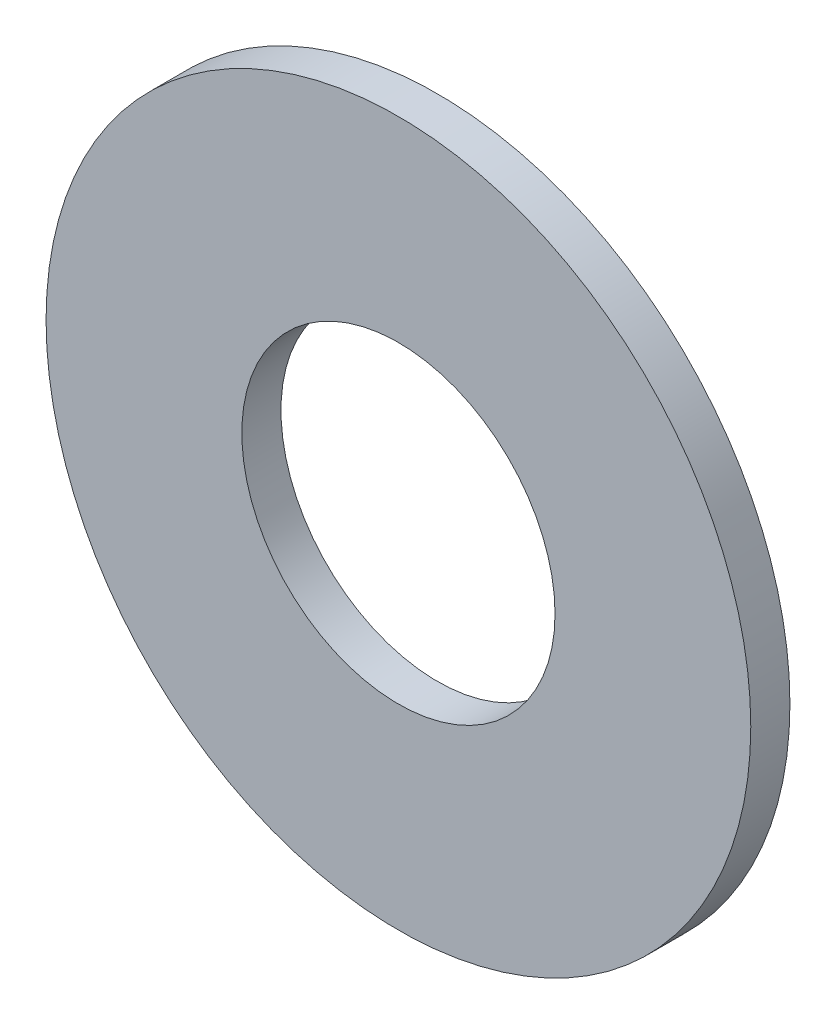
ISO-10303-21;
HEADER;
FILE_DESCRIPTION(('STEP AP214'),'2;1');
FILE_NAME('part.step','',(''),(''),'','','');
FILE_SCHEMA(('AUTOMOTIVE_DESIGN { 1 0 10303 214 1 1 1 1 }'));
ENDSEC;
DATA;
#1=APPLICATION_CONTEXT('core data for automotive mechanical design processes');
#2=APPLICATION_PROTOCOL_DEFINITION('international standard','automotive_design',2000,#1);
#3=PRODUCT_CONTEXT('',#1,'mechanical');
#4=PRODUCT('Part','Part','',(#3));
#5=PRODUCT_RELATED_PRODUCT_CATEGORY('part','',(#4));
#6=PRODUCT_DEFINITION_FORMATION('','',#4);
#7=PRODUCT_DEFINITION_CONTEXT('part definition',#1,'design');
#8=PRODUCT_DEFINITION('design','',#6,#7);
#9=PRODUCT_DEFINITION_SHAPE('','',#8);
#10=(LENGTH_UNIT() NAMED_UNIT(*) SI_UNIT(.MILLI.,.METRE.));
#11=(NAMED_UNIT(*) PLANE_ANGLE_UNIT() SI_UNIT($,.RADIAN.));
#12=(NAMED_UNIT(*) SI_UNIT($,.STERADIAN.) SOLID_ANGLE_UNIT());
#13=UNCERTAINTY_MEASURE_WITH_UNIT(LENGTH_MEASURE(1.E-05),#10,'distance_accuracy_value','');
#14=(GEOMETRIC_REPRESENTATION_CONTEXT(3) GLOBAL_UNCERTAINTY_ASSIGNED_CONTEXT((#13)) GLOBAL_UNIT_ASSIGNED_CONTEXT((#10,
#11,#12)) REPRESENTATION_CONTEXT('',''));
#15=CARTESIAN_POINT('',(0.,0.,0.));
#16=DIRECTION('',(0.,0.,1.));
#17=DIRECTION('',(1.,0.,0.));
#18=AXIS2_PLACEMENT_3D('',#15,#16,#17);
#19=CARTESIAN_POINT('',(0.,0.,1.));
#20=DIRECTION('',(0.,0.,1.));
#21=DIRECTION('',(1.,0.,0.));
#22=AXIS2_PLACEMENT_3D('',#19,#20,#21);
#23=PLANE('',#22);
#24=CARTESIAN_POINT('',(0.,0.,1.));
#25=DIRECTION('',(0.,0.,1.));
#26=DIRECTION('',(1.,0.,0.));
#27=AXIS2_PLACEMENT_3D('',#24,#25,#26);
#28=CIRCLE('',#27,9.);
#29=CARTESIAN_POINT('',(9.,0.,1.));
#30=VERTEX_POINT('',#29);
#31=EDGE_CURVE('E10',#30,#30,#28,.T.);
#32=ORIENTED_EDGE('',*,*,#31,.T.);
#33=EDGE_LOOP('',(#32));
#34=FACE_BOUND('',#33,.T.);
#35=CARTESIAN_POINT('',(0.,0.,1.));
#36=DIRECTION('',(0.,0.,1.));
#37=DIRECTION('',(1.,0.,0.));
#38=AXIS2_PLACEMENT_3D('',#35,#36,#37);
#39=CIRCLE('',#38,4.);
#40=CARTESIAN_POINT('',(4.,0.,1.));
#41=VERTEX_POINT('',#40);
#42=EDGE_CURVE('E41',#41,#41,#39,.T.);
#43=ORIENTED_EDGE('',*,*,#42,.F.);
#44=EDGE_LOOP('',(#43));
#45=FACE_BOUND('',#44,.T.);
#46=ADVANCED_FACE('F30',(#34,#45),#23,.T.);
#47=CARTESIAN_POINT('',(0.,0.,0.));
#48=DIRECTION('',(0.,0.,1.));
#49=DIRECTION('',(1.,0.,0.));
#50=AXIS2_PLACEMENT_3D('',#47,#48,#49);
#51=PLANE('',#50);
#52=CARTESIAN_POINT('',(0.,0.,0.));
#53=DIRECTION('',(0.,0.,1.));
#54=DIRECTION('',(1.,0.,0.));
#55=AXIS2_PLACEMENT_3D('',#52,#53,#54);
#56=CIRCLE('',#55,9.);
#57=CARTESIAN_POINT('',(9.,0.,0.));
#58=VERTEX_POINT('',#57);
#59=EDGE_CURVE('E34',#58,#58,#56,.T.);
#60=ORIENTED_EDGE('',*,*,#59,.F.);
#61=EDGE_LOOP('',(#60));
#62=FACE_BOUND('',#61,.T.);
#63=CARTESIAN_POINT('',(0.,0.,0.));
#64=DIRECTION('',(0.,0.,1.));
#65=DIRECTION('',(1.,0.,0.));
#66=AXIS2_PLACEMENT_3D('',#63,#64,#65);
#67=CIRCLE('',#66,4.);
#68=CARTESIAN_POINT('',(4.,0.,0.));
#69=VERTEX_POINT('',#68);
#70=EDGE_CURVE('E43',#69,#69,#67,.T.);
#71=ORIENTED_EDGE('',*,*,#70,.T.);
#72=EDGE_LOOP('',(#71));
#73=FACE_BOUND('',#72,.T.);
#74=ADVANCED_FACE('F53',(#62,#73),#51,.F.);
#75=CARTESIAN_POINT('',(0.,0.,1.));
#76=DIRECTION('',(0.,0.,-1.));
#77=DIRECTION('',(-1.,0.,0.));
#78=AXIS2_PLACEMENT_3D('',#75,#76,#77);
#79=CYLINDRICAL_SURFACE('',#78,9.);
#80=ORIENTED_EDGE('',*,*,#31,.F.);
#81=EDGE_LOOP('',(#80));
#82=FACE_BOUND('',#81,.T.);
#83=ORIENTED_EDGE('',*,*,#59,.T.);
#84=EDGE_LOOP('',(#83));
#85=FACE_BOUND('',#84,.T.);
#86=ADVANCED_FACE('F32',(#82,#85),#79,.T.);
#87=CARTESIAN_POINT('',(0.,0.,1.));
#88=DIRECTION('',(0.,0.,-1.));
#89=DIRECTION('',(-1.,0.,0.));
#90=AXIS2_PLACEMENT_3D('',#87,#88,#89);
#91=CYLINDRICAL_SURFACE('',#90,4.);
#92=ORIENTED_EDGE('',*,*,#42,.T.);
#93=EDGE_LOOP('',(#92));
#94=FACE_BOUND('',#93,.T.);
#95=ORIENTED_EDGE('',*,*,#70,.F.);
#96=EDGE_LOOP('',(#95));
#97=FACE_BOUND('',#96,.T.);
#98=ADVANCED_FACE('F49',(#94,#97),#91,.F.);
#99=CLOSED_SHELL('',(#46,#74,#86,#98));
#100=MANIFOLD_SOLID_BREP('B2',#99);
#101=ADVANCED_BREP_SHAPE_REPRESENTATION('',(#18,#100),#14);
#102=SHAPE_DEFINITION_REPRESENTATION(#9,#101);
ENDSEC;
END-ISO-10303-21;
